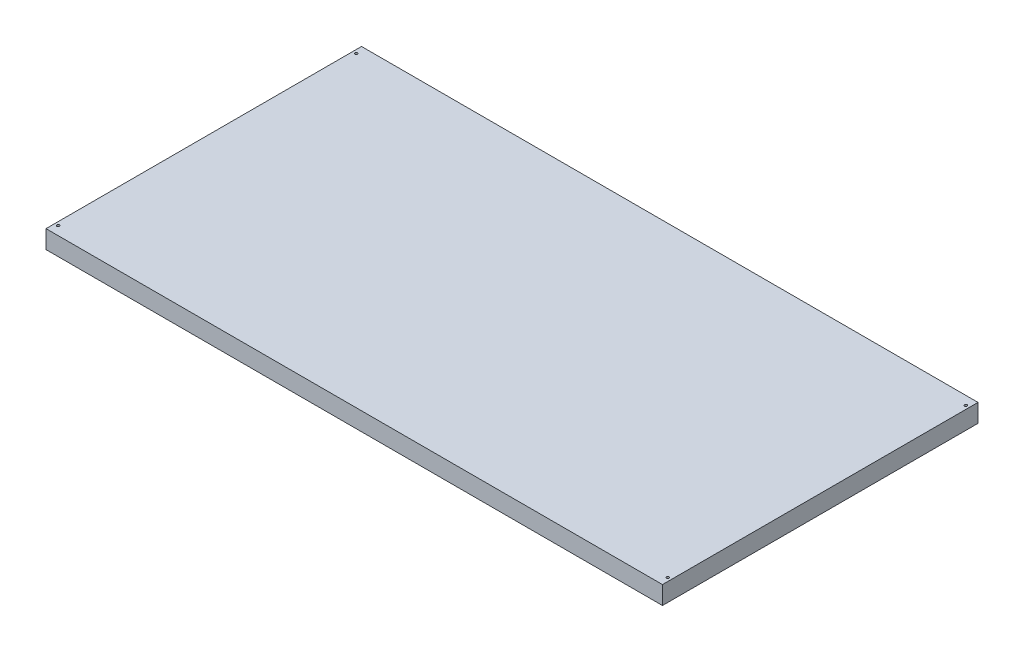
ISO-10303-21;
HEADER;
FILE_DESCRIPTION(('STEP AP214'),'2;1');
FILE_NAME('part.step','',(''),(''),'','','');
FILE_SCHEMA(('AUTOMOTIVE_DESIGN { 1 0 10303 214 1 1 1 1 }'));
ENDSEC;
DATA;
#1=APPLICATION_CONTEXT('core data for automotive mechanical design processes');
#2=APPLICATION_PROTOCOL_DEFINITION('international standard','automotive_design',2000,#1);
#3=PRODUCT_CONTEXT('',#1,'mechanical');
#4=PRODUCT('Part','Part','',(#3));
#5=PRODUCT_RELATED_PRODUCT_CATEGORY('part','',(#4));
#6=PRODUCT_DEFINITION_FORMATION('','',#4);
#7=PRODUCT_DEFINITION_CONTEXT('part definition',#1,'design');
#8=PRODUCT_DEFINITION('design','',#6,#7);
#9=PRODUCT_DEFINITION_SHAPE('','',#8);
#10=(LENGTH_UNIT() NAMED_UNIT(*) SI_UNIT(.MILLI.,.METRE.));
#11=(NAMED_UNIT(*) PLANE_ANGLE_UNIT() SI_UNIT($,.RADIAN.));
#12=(NAMED_UNIT(*) SI_UNIT($,.STERADIAN.) SOLID_ANGLE_UNIT());
#13=UNCERTAINTY_MEASURE_WITH_UNIT(LENGTH_MEASURE(1.E-05),#10,'distance_accuracy_value','');
#14=(GEOMETRIC_REPRESENTATION_CONTEXT(3) GLOBAL_UNCERTAINTY_ASSIGNED_CONTEXT((#13)) GLOBAL_UNIT_ASSIGNED_CONTEXT((#10,
#11,#12)) REPRESENTATION_CONTEXT('',''));
#15=CARTESIAN_POINT('',(0.,0.,0.));
#16=DIRECTION('',(0.,0.,1.));
#17=DIRECTION('',(1.,0.,0.));
#18=AXIS2_PLACEMENT_3D('',#15,#16,#17);
#19=CARTESIAN_POINT('',(779.653,45.974,-399.034));
#20=DIRECTION('',(-1.,0.,0.));
#21=DIRECTION('',(0.,0.,1.));
#22=AXIS2_PLACEMENT_3D('',#19,#20,#21);
#23=PLANE('',#22);
#24=DIRECTION('',(0.,0.,-1.));
#25=VECTOR('',#24,1.);
#26=CARTESIAN_POINT('',(779.653,0.,-399.034));
#27=LINE('',#26,#25);
#28=CARTESIAN_POINT('',(779.653,0.,399.034));
#29=VERTEX_POINT('',#28);
#30=CARTESIAN_POINT('',(779.653,0.,-399.034));
#31=VERTEX_POINT('',#30);
#32=EDGE_CURVE('E106',#29,#31,#27,.T.);
#33=ORIENTED_EDGE('',*,*,#32,.T.);
#34=DIRECTION('',(0.,-1.,0.));
#35=VECTOR('',#34,1.);
#36=CARTESIAN_POINT('',(779.653,45.974,-399.034));
#37=LINE('',#36,#35);
#38=CARTESIAN_POINT('',(779.653,45.974,-399.034));
#39=VERTEX_POINT('',#38);
#40=EDGE_CURVE('E11',#39,#31,#37,.T.);
#41=ORIENTED_EDGE('',*,*,#40,.F.);
#42=DIRECTION('',(0.,0.,-1.));
#43=VECTOR('',#42,1.);
#44=CARTESIAN_POINT('',(779.653,45.974,-399.034));
#45=LINE('',#44,#43);
#46=CARTESIAN_POINT('',(779.653,45.974,399.034));
#47=VERTEX_POINT('',#46);
#48=EDGE_CURVE('E94',#47,#39,#45,.T.);
#49=ORIENTED_EDGE('',*,*,#48,.F.);
#50=DIRECTION('',(0.,-1.,0.));
#51=VECTOR('',#50,1.);
#52=CARTESIAN_POINT('',(779.653,45.974,399.034));
#53=LINE('',#52,#51);
#54=EDGE_CURVE('E102',#47,#29,#53,.T.);
#55=ORIENTED_EDGE('',*,*,#54,.T.);
#56=EDGE_LOOP('',(#33,#41,#49,#55));
#57=FACE_BOUND('',#56,.T.);
#58=ADVANCED_FACE('F43',(#57),#23,.F.);
#59=CARTESIAN_POINT('',(-779.653,45.974,-399.034));
#60=DIRECTION('',(0.,0.,1.));
#61=DIRECTION('',(1.,0.,0.));
#62=AXIS2_PLACEMENT_3D('',#59,#60,#61);
#63=PLANE('',#62);
#64=DIRECTION('',(-1.,0.,0.));
#65=VECTOR('',#64,1.);
#66=CARTESIAN_POINT('',(-779.653,0.,-399.034));
#67=LINE('',#66,#65);
#68=CARTESIAN_POINT('',(-779.653,0.,-399.034));
#69=VERTEX_POINT('',#68);
#70=EDGE_CURVE('E98',#31,#69,#67,.T.);
#71=ORIENTED_EDGE('',*,*,#70,.T.);
#72=DIRECTION('',(0.,-1.,0.));
#73=VECTOR('',#72,1.);
#74=CARTESIAN_POINT('',(-779.653,45.974,-399.034));
#75=LINE('',#74,#73);
#76=CARTESIAN_POINT('',(-779.653,45.974,-399.034));
#77=VERTEX_POINT('',#76);
#78=EDGE_CURVE('E51',#77,#69,#75,.T.);
#79=ORIENTED_EDGE('',*,*,#78,.F.);
#80=DIRECTION('',(-1.,0.,0.));
#81=VECTOR('',#80,1.);
#82=CARTESIAN_POINT('',(-779.653,45.974,-399.034));
#83=LINE('',#82,#81);
#84=EDGE_CURVE('E89',#39,#77,#83,.T.);
#85=ORIENTED_EDGE('',*,*,#84,.F.);
#86=ORIENTED_EDGE('',*,*,#40,.T.);
#87=EDGE_LOOP('',(#71,#79,#85,#86));
#88=FACE_BOUND('',#87,.T.);
#89=ADVANCED_FACE('F97',(#88),#63,.F.);
#90=CARTESIAN_POINT('',(-779.653,45.974,-399.034));
#91=DIRECTION('',(1.,0.,0.));
#92=DIRECTION('',(0.,0.,-1.));
#93=AXIS2_PLACEMENT_3D('',#90,#91,#92);
#94=PLANE('',#93);
#95=DIRECTION('',(0.,0.,1.));
#96=VECTOR('',#95,1.);
#97=CARTESIAN_POINT('',(-779.653,0.,-399.034));
#98=LINE('',#97,#96);
#99=CARTESIAN_POINT('',(-779.653,0.,399.034));
#100=VERTEX_POINT('',#99);
#101=EDGE_CURVE('E76',#69,#100,#98,.T.);
#102=ORIENTED_EDGE('',*,*,#101,.T.);
#103=DIRECTION('',(0.,-1.,0.));
#104=VECTOR('',#103,1.);
#105=CARTESIAN_POINT('',(-779.653,45.974,399.034));
#106=LINE('',#105,#104);
#107=CARTESIAN_POINT('',(-779.653,45.974,399.034));
#108=VERTEX_POINT('',#107);
#109=EDGE_CURVE('E99',#108,#100,#106,.T.);
#110=ORIENTED_EDGE('',*,*,#109,.F.);
#111=DIRECTION('',(0.,0.,1.));
#112=VECTOR('',#111,1.);
#113=CARTESIAN_POINT('',(-779.653,45.974,-399.034));
#114=LINE('',#113,#112);
#115=EDGE_CURVE('E92',#77,#108,#114,.T.);
#116=ORIENTED_EDGE('',*,*,#115,.F.);
#117=ORIENTED_EDGE('',*,*,#78,.T.);
#118=EDGE_LOOP('',(#102,#110,#116,#117));
#119=FACE_BOUND('',#118,.T.);
#120=ADVANCED_FACE('F100',(#119),#94,.F.);
#121=CARTESIAN_POINT('',(-779.653,45.974,399.034));
#122=DIRECTION('',(0.,0.,-1.));
#123=DIRECTION('',(-1.,0.,0.));
#124=AXIS2_PLACEMENT_3D('',#121,#122,#123);
#125=PLANE('',#124);
#126=DIRECTION('',(1.,0.,0.));
#127=VECTOR('',#126,1.);
#128=CARTESIAN_POINT('',(-779.653,0.,399.034));
#129=LINE('',#128,#127);
#130=EDGE_CURVE('E82',#100,#29,#129,.T.);
#131=ORIENTED_EDGE('',*,*,#130,.T.);
#132=ORIENTED_EDGE('',*,*,#54,.F.);
#133=DIRECTION('',(1.,0.,0.));
#134=VECTOR('',#133,1.);
#135=CARTESIAN_POINT('',(-779.653,45.974,399.034));
#136=LINE('',#135,#134);
#137=EDGE_CURVE('E59',#108,#47,#136,.T.);
#138=ORIENTED_EDGE('',*,*,#137,.F.);
#139=ORIENTED_EDGE('',*,*,#109,.T.);
#140=EDGE_LOOP('',(#131,#132,#138,#139));
#141=FACE_BOUND('',#140,.T.);
#142=ADVANCED_FACE('F114',(#141),#125,.F.);
#143=CARTESIAN_POINT('',(0.,45.974,0.));
#144=DIRECTION('',(0.,1.,0.));
#145=DIRECTION('',(0.,0.,1.));
#146=AXIS2_PLACEMENT_3D('',#143,#144,#145);
#147=PLANE('',#146);
#148=CARTESIAN_POINT('',(-771.017,45.974,377.063));
#149=DIRECTION('',(0.,1.,0.));
#150=DIRECTION('',(0.,0.,-1.));
#151=AXIS2_PLACEMENT_3D('',#148,#149,#150);
#152=CIRCLE('',#151,3.30200000000004);
#153=CARTESIAN_POINT('',(-771.017,45.974,373.761));
#154=VERTEX_POINT('',#153);
#155=EDGE_CURVE('E129',#154,#154,#152,.T.);
#156=ORIENTED_EDGE('',*,*,#155,.F.);
#157=EDGE_LOOP('',(#156));
#158=FACE_BOUND('',#157,.T.);
#159=CARTESIAN_POINT('',(771.017,45.974,377.063));
#160=DIRECTION('',(0.,1.,0.));
#161=DIRECTION('',(0.,0.,1.));
#162=AXIS2_PLACEMENT_3D('',#159,#160,#161);
#163=CIRCLE('',#162,3.30200000000004);
#164=CARTESIAN_POINT('',(771.017,45.974,380.365));
#165=VERTEX_POINT('',#164);
#166=EDGE_CURVE('E135',#165,#165,#163,.T.);
#167=ORIENTED_EDGE('',*,*,#166,.F.);
#168=EDGE_LOOP('',(#167));
#169=FACE_BOUND('',#168,.T.);
#170=CARTESIAN_POINT('',(771.017,45.974,-377.063));
#171=DIRECTION('',(0.,1.,0.));
#172=DIRECTION('',(0.,0.,-1.));
#173=AXIS2_PLACEMENT_3D('',#170,#171,#172);
#174=CIRCLE('',#173,3.30200000000004);
#175=CARTESIAN_POINT('',(771.017,45.974,-380.365));
#176=VERTEX_POINT('',#175);
#177=EDGE_CURVE('E123',#176,#176,#174,.T.);
#178=ORIENTED_EDGE('',*,*,#177,.F.);
#179=EDGE_LOOP('',(#178));
#180=FACE_BOUND('',#179,.T.);
#181=CARTESIAN_POINT('',(-771.017,45.974,-377.063));
#182=DIRECTION('',(0.,1.,0.));
#183=DIRECTION('',(0.,0.,1.));
#184=AXIS2_PLACEMENT_3D('',#181,#182,#183);
#185=CIRCLE('',#184,3.30200000000004);
#186=CARTESIAN_POINT('',(-771.017,45.974,-373.761));
#187=VERTEX_POINT('',#186);
#188=EDGE_CURVE('E120',#187,#187,#185,.T.);
#189=ORIENTED_EDGE('',*,*,#188,.F.);
#190=EDGE_LOOP('',(#189));
#191=FACE_BOUND('',#190,.T.);
#192=ORIENTED_EDGE('',*,*,#48,.T.);
#193=ORIENTED_EDGE('',*,*,#84,.T.);
#194=ORIENTED_EDGE('',*,*,#115,.T.);
#195=ORIENTED_EDGE('',*,*,#137,.T.);
#196=EDGE_LOOP('',(#192,#193,#194,#195));
#197=FACE_BOUND('',#196,.T.);
#198=ADVANCED_FACE('F90',(#158,#169,#180,#191,#197),#147,.T.);
#199=CARTESIAN_POINT('',(0.,0.,0.));
#200=DIRECTION('',(0.,1.,0.));
#201=DIRECTION('',(0.,0.,1.));
#202=AXIS2_PLACEMENT_3D('',#199,#200,#201);
#203=PLANE('',#202);
#204=CARTESIAN_POINT('',(-771.017,0.,377.063));
#205=DIRECTION('',(0.,1.,0.));
#206=DIRECTION('',(0.,0.,-1.));
#207=AXIS2_PLACEMENT_3D('',#204,#205,#206);
#208=CIRCLE('',#207,3.30200000000004);
#209=CARTESIAN_POINT('',(-771.017,0.,373.761));
#210=VERTEX_POINT('',#209);
#211=EDGE_CURVE('E126',#210,#210,#208,.T.);
#212=ORIENTED_EDGE('',*,*,#211,.T.);
#213=EDGE_LOOP('',(#212));
#214=FACE_BOUND('',#213,.T.);
#215=CARTESIAN_POINT('',(771.017,0.,377.063));
#216=DIRECTION('',(0.,1.,0.));
#217=DIRECTION('',(0.,0.,1.));
#218=AXIS2_PLACEMENT_3D('',#215,#216,#217);
#219=CIRCLE('',#218,3.30200000000004);
#220=CARTESIAN_POINT('',(771.017,0.,380.365));
#221=VERTEX_POINT('',#220);
#222=EDGE_CURVE('E132',#221,#221,#219,.T.);
#223=ORIENTED_EDGE('',*,*,#222,.T.);
#224=EDGE_LOOP('',(#223));
#225=FACE_BOUND('',#224,.T.);
#226=CARTESIAN_POINT('',(771.017,0.,-377.063));
#227=DIRECTION('',(0.,1.,0.));
#228=DIRECTION('',(0.,0.,-1.));
#229=AXIS2_PLACEMENT_3D('',#226,#227,#228);
#230=CIRCLE('',#229,3.30200000000004);
#231=CARTESIAN_POINT('',(771.017,0.,-380.365));
#232=VERTEX_POINT('',#231);
#233=EDGE_CURVE('E138',#232,#232,#230,.T.);
#234=ORIENTED_EDGE('',*,*,#233,.T.);
#235=EDGE_LOOP('',(#234));
#236=FACE_BOUND('',#235,.T.);
#237=CARTESIAN_POINT('',(-771.017,0.,-377.063));
#238=DIRECTION('',(0.,1.,0.));
#239=DIRECTION('',(0.,0.,1.));
#240=AXIS2_PLACEMENT_3D('',#237,#238,#239);
#241=CIRCLE('',#240,3.30200000000004);
#242=CARTESIAN_POINT('',(-771.017,0.,-373.761));
#243=VERTEX_POINT('',#242);
#244=EDGE_CURVE('E109',#243,#243,#241,.T.);
#245=ORIENTED_EDGE('',*,*,#244,.T.);
#246=EDGE_LOOP('',(#245));
#247=FACE_BOUND('',#246,.T.);
#248=ORIENTED_EDGE('',*,*,#32,.F.);
#249=ORIENTED_EDGE('',*,*,#130,.F.);
#250=ORIENTED_EDGE('',*,*,#101,.F.);
#251=ORIENTED_EDGE('',*,*,#70,.F.);
#252=EDGE_LOOP('',(#248,#249,#250,#251));
#253=FACE_BOUND('',#252,.T.);
#254=ADVANCED_FACE('F117',(#214,#225,#236,#247,#253),#203,.F.);
#255=CARTESIAN_POINT('',(-771.017,0.,-377.063));
#256=DIRECTION('',(0.,1.,0.));
#257=DIRECTION('',(0.,0.,1.));
#258=AXIS2_PLACEMENT_3D('',#255,#256,#257);
#259=CYLINDRICAL_SURFACE('',#258,3.30200000000004);
#260=ORIENTED_EDGE('',*,*,#244,.F.);
#261=EDGE_LOOP('',(#260));
#262=FACE_BOUND('',#261,.T.);
#263=ORIENTED_EDGE('',*,*,#188,.T.);
#264=EDGE_LOOP('',(#263));
#265=FACE_BOUND('',#264,.T.);
#266=ADVANCED_FACE('F152',(#262,#265),#259,.F.);
#267=CARTESIAN_POINT('',(771.017,0.,-377.063));
#268=DIRECTION('',(0.,1.,0.));
#269=DIRECTION('',(0.,0.,1.));
#270=AXIS2_PLACEMENT_3D('',#267,#268,#269);
#271=CYLINDRICAL_SURFACE('',#270,3.30200000000004);
#272=ORIENTED_EDGE('',*,*,#233,.F.);
#273=EDGE_LOOP('',(#272));
#274=FACE_BOUND('',#273,.T.);
#275=ORIENTED_EDGE('',*,*,#177,.T.);
#276=EDGE_LOOP('',(#275));
#277=FACE_BOUND('',#276,.T.);
#278=ADVANCED_FACE('F144',(#274,#277),#271,.F.);
#279=CARTESIAN_POINT('',(771.017,0.,377.063));
#280=DIRECTION('',(0.,1.,0.));
#281=DIRECTION('',(0.,0.,1.));
#282=AXIS2_PLACEMENT_3D('',#279,#280,#281);
#283=CYLINDRICAL_SURFACE('',#282,3.30200000000004);
#284=ORIENTED_EDGE('',*,*,#222,.F.);
#285=EDGE_LOOP('',(#284));
#286=FACE_BOUND('',#285,.T.);
#287=ORIENTED_EDGE('',*,*,#166,.T.);
#288=EDGE_LOOP('',(#287));
#289=FACE_BOUND('',#288,.T.);
#290=ADVANCED_FACE('F160',(#286,#289),#283,.F.);
#291=CARTESIAN_POINT('',(-771.017,0.,377.063));
#292=DIRECTION('',(0.,1.,0.));
#293=DIRECTION('',(0.,0.,1.));
#294=AXIS2_PLACEMENT_3D('',#291,#292,#293);
#295=CYLINDRICAL_SURFACE('',#294,3.30200000000004);
#296=ORIENTED_EDGE('',*,*,#211,.F.);
#297=EDGE_LOOP('',(#296));
#298=FACE_BOUND('',#297,.T.);
#299=ORIENTED_EDGE('',*,*,#155,.T.);
#300=EDGE_LOOP('',(#299));
#301=FACE_BOUND('',#300,.T.);
#302=ADVANCED_FACE('F211',(#298,#301),#295,.F.);
#303=CLOSED_SHELL('',(#58,#89,#120,#142,#198,#254,#266,#278,#290,#302));
#304=MANIFOLD_SOLID_BREP('B2',#303);
#305=ADVANCED_BREP_SHAPE_REPRESENTATION('',(#18,#304),#14);
#306=SHAPE_DEFINITION_REPRESENTATION(#9,#305);
ENDSEC;
END-ISO-10303-21;
